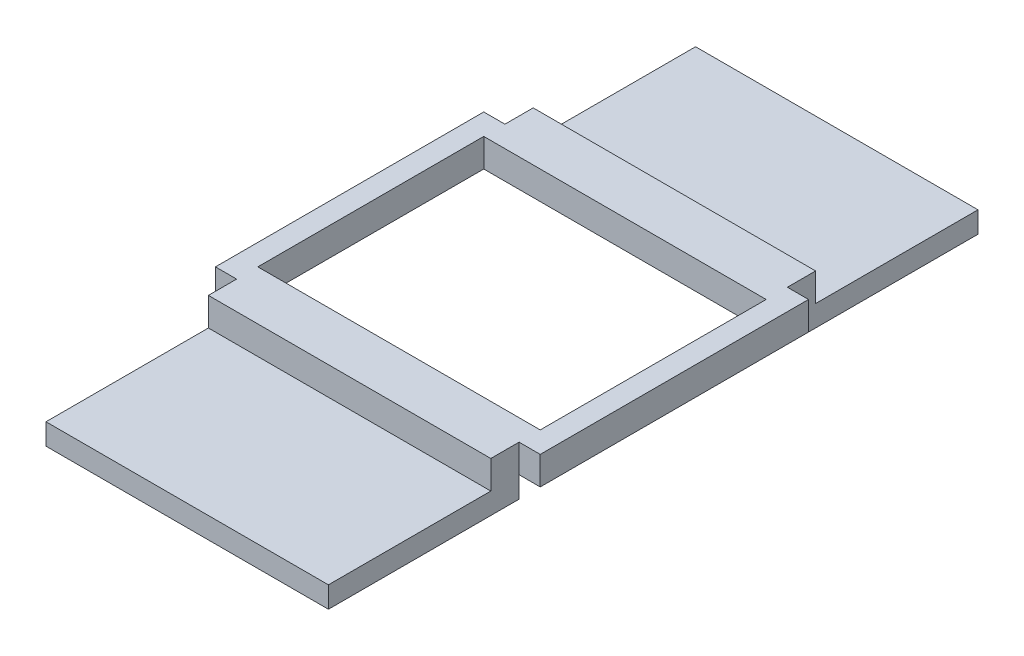
ISO-10303-21;
HEADER;
FILE_DESCRIPTION(('STEP AP214'),'2;1');
FILE_NAME('part.step','',(''),(''),'','','');
FILE_SCHEMA(('AUTOMOTIVE_DESIGN { 1 0 10303 214 1 1 1 1 }'));
ENDSEC;
DATA;
#1=APPLICATION_CONTEXT('core data for automotive mechanical design processes');
#2=APPLICATION_PROTOCOL_DEFINITION('international standard','automotive_design',2000,#1);
#3=PRODUCT_CONTEXT('',#1,'mechanical');
#4=PRODUCT('Part','Part','',(#3));
#5=PRODUCT_RELATED_PRODUCT_CATEGORY('part','',(#4));
#6=PRODUCT_DEFINITION_FORMATION('','',#4);
#7=PRODUCT_DEFINITION_CONTEXT('part definition',#1,'design');
#8=PRODUCT_DEFINITION('design','',#6,#7);
#9=PRODUCT_DEFINITION_SHAPE('','',#8);
#10=(LENGTH_UNIT() NAMED_UNIT(*) SI_UNIT(.MILLI.,.METRE.));
#11=(NAMED_UNIT(*) PLANE_ANGLE_UNIT() SI_UNIT($,.RADIAN.));
#12=(NAMED_UNIT(*) SI_UNIT($,.STERADIAN.) SOLID_ANGLE_UNIT());
#13=UNCERTAINTY_MEASURE_WITH_UNIT(LENGTH_MEASURE(1.E-05),#10,'distance_accuracy_value','');
#14=(GEOMETRIC_REPRESENTATION_CONTEXT(3) GLOBAL_UNCERTAINTY_ASSIGNED_CONTEXT((#13)) GLOBAL_UNIT_ASSIGNED_CONTEXT((#10,
#11,#12)) REPRESENTATION_CONTEXT('',''));
#15=CARTESIAN_POINT('',(0.,0.,0.));
#16=DIRECTION('',(0.,0.,1.));
#17=DIRECTION('',(1.,0.,0.));
#18=AXIS2_PLACEMENT_3D('',#15,#16,#17);
#19=CARTESIAN_POINT('',(-11.5,2.,9.5));
#20=DIRECTION('',(0.,0.,-1.));
#21=DIRECTION('',(-1.,0.,0.));
#22=AXIS2_PLACEMENT_3D('',#19,#20,#21);
#23=PLANE('',#22);
#24=DIRECTION('',(0.,-1.,0.));
#25=VECTOR('',#24,1.);
#26=CARTESIAN_POINT('',(-10.,2.,9.5));
#27=LINE('',#26,#25);
#28=CARTESIAN_POINT('',(-10.,2.,9.5));
#29=VERTEX_POINT('',#28);
#30=CARTESIAN_POINT('',(-10.,0.,9.5));
#31=VERTEX_POINT('',#30);
#32=EDGE_CURVE('E257',#29,#31,#27,.T.);
#33=ORIENTED_EDGE('',*,*,#32,.F.);
#34=DIRECTION('',(1.,0.,0.));
#35=VECTOR('',#34,1.);
#36=CARTESIAN_POINT('',(-11.5,2.,9.5));
#37=LINE('',#36,#35);
#38=CARTESIAN_POINT('',(-11.5,2.,9.5));
#39=VERTEX_POINT('',#38);
#40=EDGE_CURVE('E403',#39,#29,#37,.T.);
#41=ORIENTED_EDGE('',*,*,#40,.F.);
#42=DIRECTION('',(0.,-1.,0.));
#43=VECTOR('',#42,1.);
#44=CARTESIAN_POINT('',(-11.5,2.,9.5));
#45=LINE('',#44,#43);
#46=CARTESIAN_POINT('',(-11.5,0.,9.5));
#47=VERTEX_POINT('',#46);
#48=EDGE_CURVE('E426',#39,#47,#45,.T.);
#49=ORIENTED_EDGE('',*,*,#48,.T.);
#50=DIRECTION('',(1.,0.,0.));
#51=VECTOR('',#50,1.);
#52=CARTESIAN_POINT('',(-11.5,0.,9.5));
#53=LINE('',#52,#51);
#54=EDGE_CURVE('E394',#47,#31,#53,.T.);
#55=ORIENTED_EDGE('',*,*,#54,.T.);
#56=EDGE_LOOP('',(#33,#41,#49,#55));
#57=FACE_BOUND('',#56,.T.);
#58=ADVANCED_FACE('F45',(#57),#23,.F.);
#59=CARTESIAN_POINT('',(-11.5,2.,-9.5));
#60=DIRECTION('',(0.,0.,1.));
#61=DIRECTION('',(1.,0.,0.));
#62=AXIS2_PLACEMENT_3D('',#59,#60,#61);
#63=PLANE('',#62);
#64=DIRECTION('',(0.,-1.,0.));
#65=VECTOR('',#64,1.);
#66=CARTESIAN_POINT('',(10.,2.,-9.5));
#67=LINE('',#66,#65);
#68=CARTESIAN_POINT('',(10.,2.,-9.5));
#69=VERTEX_POINT('',#68);
#70=CARTESIAN_POINT('',(10.,0.,-9.5));
#71=VERTEX_POINT('',#70);
#72=EDGE_CURVE('E328',#69,#71,#67,.T.);
#73=ORIENTED_EDGE('',*,*,#72,.F.);
#74=DIRECTION('',(-1.,0.,0.));
#75=VECTOR('',#74,1.);
#76=CARTESIAN_POINT('',(-11.5,2.,-9.5));
#77=LINE('',#76,#75);
#78=CARTESIAN_POINT('',(11.5,2.,-9.5));
#79=VERTEX_POINT('',#78);
#80=EDGE_CURVE('E395',#79,#69,#77,.T.);
#81=ORIENTED_EDGE('',*,*,#80,.F.);
#82=DIRECTION('',(0.,-1.,0.));
#83=VECTOR('',#82,1.);
#84=CARTESIAN_POINT('',(11.5,2.,-9.5));
#85=LINE('',#84,#83);
#86=CARTESIAN_POINT('',(11.5,0.,-9.5));
#87=VERTEX_POINT('',#86);
#88=EDGE_CURVE('E11',#79,#87,#85,.T.);
#89=ORIENTED_EDGE('',*,*,#88,.T.);
#90=DIRECTION('',(-1.,0.,0.));
#91=VECTOR('',#90,1.);
#92=CARTESIAN_POINT('',(-11.5,0.,-9.5));
#93=LINE('',#92,#91);
#94=EDGE_CURVE('E412',#87,#71,#93,.T.);
#95=ORIENTED_EDGE('',*,*,#94,.T.);
#96=EDGE_LOOP('',(#73,#81,#89,#95));
#97=FACE_BOUND('',#96,.T.);
#98=ADVANCED_FACE('F472',(#97),#63,.F.);
#99=CARTESIAN_POINT('',(0.,2.,0.));
#100=DIRECTION('',(0.,1.,0.));
#101=DIRECTION('',(0.,0.,1.));
#102=AXIS2_PLACEMENT_3D('',#99,#100,#101);
#103=PLANE('',#102);
#104=DIRECTION('',(0.,0.,-1.));
#105=VECTOR('',#104,1.);
#106=CARTESIAN_POINT('',(11.5,2.,-9.5));
#107=LINE('',#106,#105);
#108=CARTESIAN_POINT('',(11.5,2.,9.5));
#109=VERTEX_POINT('',#108);
#110=EDGE_CURVE('E389',#109,#79,#107,.T.);
#111=ORIENTED_EDGE('',*,*,#110,.T.);
#112=ORIENTED_EDGE('',*,*,#80,.T.);
#113=DIRECTION('',(0.,0.,-1.));
#114=VECTOR('',#113,1.);
#115=CARTESIAN_POINT('',(10.,2.,-9.5));
#116=LINE('',#115,#114);
#117=CARTESIAN_POINT('',(10.,2.,-11.5));
#118=VERTEX_POINT('',#117);
#119=EDGE_CURVE('E318',#69,#118,#116,.T.);
#120=ORIENTED_EDGE('',*,*,#119,.T.);
#121=DIRECTION('',(-1.,0.,0.));
#122=VECTOR('',#121,1.);
#123=CARTESIAN_POINT('',(10.,2.,-11.5));
#124=LINE('',#123,#122);
#125=CARTESIAN_POINT('',(-10.,2.,-11.5));
#126=VERTEX_POINT('',#125);
#127=EDGE_CURVE('E322',#118,#126,#124,.T.);
#128=ORIENTED_EDGE('',*,*,#127,.T.);
#129=DIRECTION('',(0.,0.,1.));
#130=VECTOR('',#129,1.);
#131=CARTESIAN_POINT('',(-10.,2.,-9.5));
#132=LINE('',#131,#130);
#133=CARTESIAN_POINT('',(-10.,2.,-9.5));
#134=VERTEX_POINT('',#133);
#135=EDGE_CURVE('E325',#126,#134,#132,.T.);
#136=ORIENTED_EDGE('',*,*,#135,.T.);
#137=CARTESIAN_POINT('',(-11.5,2.,-9.5));
#138=VERTEX_POINT('',#137);
#139=EDGE_CURVE('E393',#134,#138,#77,.T.);
#140=ORIENTED_EDGE('',*,*,#139,.T.);
#141=DIRECTION('',(0.,0.,1.));
#142=VECTOR('',#141,1.);
#143=CARTESIAN_POINT('',(-11.5,2.,-9.5));
#144=LINE('',#143,#142);
#145=EDGE_CURVE('E399',#138,#39,#144,.T.);
#146=ORIENTED_EDGE('',*,*,#145,.T.);
#147=ORIENTED_EDGE('',*,*,#40,.T.);
#148=DIRECTION('',(0.,0.,1.));
#149=VECTOR('',#148,1.);
#150=CARTESIAN_POINT('',(-10.,2.,9.5));
#151=LINE('',#150,#149);
#152=CARTESIAN_POINT('',(-10.,2.,11.5));
#153=VERTEX_POINT('',#152);
#154=EDGE_CURVE('E267',#29,#153,#151,.T.);
#155=ORIENTED_EDGE('',*,*,#154,.T.);
#156=DIRECTION('',(1.,0.,0.));
#157=VECTOR('',#156,1.);
#158=CARTESIAN_POINT('',(-10.,2.,11.5));
#159=LINE('',#158,#157);
#160=CARTESIAN_POINT('',(10.,2.,11.5));
#161=VERTEX_POINT('',#160);
#162=EDGE_CURVE('E270',#153,#161,#159,.T.);
#163=ORIENTED_EDGE('',*,*,#162,.T.);
#164=DIRECTION('',(0.,0.,-1.));
#165=VECTOR('',#164,1.);
#166=CARTESIAN_POINT('',(10.,2.,9.5));
#167=LINE('',#166,#165);
#168=CARTESIAN_POINT('',(10.,2.,9.5));
#169=VERTEX_POINT('',#168);
#170=EDGE_CURVE('E261',#161,#169,#167,.T.);
#171=ORIENTED_EDGE('',*,*,#170,.T.);
#172=EDGE_CURVE('E402',#169,#109,#37,.T.);
#173=ORIENTED_EDGE('',*,*,#172,.T.);
#174=EDGE_LOOP('',(#111,#112,#120,#128,#136,#140,#146,#147,#155,#163,#171,#173));
#175=FACE_BOUND('',#174,.T.);
#176=DIRECTION('',(-1.,0.,0.));
#177=VECTOR('',#176,1.);
#178=CARTESIAN_POINT('',(-10.,2.,-8.));
#179=LINE('',#178,#177);
#180=CARTESIAN_POINT('',(10.,2.,-8.));
#181=VERTEX_POINT('',#180);
#182=CARTESIAN_POINT('',(-10.,2.,-8.));
#183=VERTEX_POINT('',#182);
#184=EDGE_CURVE('E351',#181,#183,#179,.T.);
#185=ORIENTED_EDGE('',*,*,#184,.F.);
#186=DIRECTION('',(0.,0.,-1.));
#187=VECTOR('',#186,1.);
#188=CARTESIAN_POINT('',(10.,2.,-8.));
#189=LINE('',#188,#187);
#190=CARTESIAN_POINT('',(10.,2.,8.));
#191=VERTEX_POINT('',#190);
#192=EDGE_CURVE('E348',#191,#181,#189,.T.);
#193=ORIENTED_EDGE('',*,*,#192,.F.);
#194=DIRECTION('',(1.,0.,0.));
#195=VECTOR('',#194,1.);
#196=CARTESIAN_POINT('',(-10.,2.,8.));
#197=LINE('',#196,#195);
#198=CARTESIAN_POINT('',(-10.,2.,8.));
#199=VERTEX_POINT('',#198);
#200=EDGE_CURVE('E358',#199,#191,#197,.T.);
#201=ORIENTED_EDGE('',*,*,#200,.F.);
#202=DIRECTION('',(0.,0.,1.));
#203=VECTOR('',#202,1.);
#204=CARTESIAN_POINT('',(-10.,2.,-8.));
#205=LINE('',#204,#203);
#206=EDGE_CURVE('E355',#183,#199,#205,.T.);
#207=ORIENTED_EDGE('',*,*,#206,.F.);
#208=EDGE_LOOP('',(#185,#193,#201,#207));
#209=FACE_BOUND('',#208,.T.);
#210=ADVANCED_FACE('F449',(#175,#209),#103,.T.);
#211=CARTESIAN_POINT('',(0.,0.,0.));
#212=DIRECTION('',(0.,1.,0.));
#213=DIRECTION('',(0.,0.,1.));
#214=AXIS2_PLACEMENT_3D('',#211,#212,#213);
#215=PLANE('',#214);
#216=CARTESIAN_POINT('',(10.,0.,9.5));
#217=VERTEX_POINT('',#216);
#218=CARTESIAN_POINT('',(11.5,0.,9.5));
#219=VERTEX_POINT('',#218);
#220=EDGE_CURVE('E419',#217,#219,#53,.T.);
#221=ORIENTED_EDGE('',*,*,#220,.F.);
#222=DIRECTION('',(-1.,0.,0.));
#223=VECTOR('',#222,1.);
#224=CARTESIAN_POINT('',(0.,0.,9.5));
#225=LINE('',#224,#223);
#226=EDGE_CURVE('E61',#217,#31,#225,.T.);
#227=ORIENTED_EDGE('',*,*,#226,.T.);
#228=ORIENTED_EDGE('',*,*,#54,.F.);
#229=DIRECTION('',(0.,0.,1.));
#230=VECTOR('',#229,1.);
#231=CARTESIAN_POINT('',(-11.5,0.,-9.5));
#232=LINE('',#231,#230);
#233=CARTESIAN_POINT('',(-11.5,0.,-9.5));
#234=VERTEX_POINT('',#233);
#235=EDGE_CURVE('E416',#234,#47,#232,.T.);
#236=ORIENTED_EDGE('',*,*,#235,.F.);
#237=CARTESIAN_POINT('',(-10.,0.,-9.5));
#238=VERTEX_POINT('',#237);
#239=EDGE_CURVE('E411',#238,#234,#93,.T.);
#240=ORIENTED_EDGE('',*,*,#239,.F.);
#241=DIRECTION('',(1.,0.,0.));
#242=VECTOR('',#241,1.);
#243=CARTESIAN_POINT('',(0.,0.,-9.5));
#244=LINE('',#243,#242);
#245=EDGE_CURVE('E266',#238,#71,#244,.T.);
#246=ORIENTED_EDGE('',*,*,#245,.T.);
#247=ORIENTED_EDGE('',*,*,#94,.F.);
#248=DIRECTION('',(0.,0.,-1.));
#249=VECTOR('',#248,1.);
#250=CARTESIAN_POINT('',(11.5,0.,-9.5));
#251=LINE('',#250,#249);
#252=EDGE_CURVE('E388',#219,#87,#251,.T.);
#253=ORIENTED_EDGE('',*,*,#252,.F.);
#254=EDGE_LOOP('',(#221,#227,#228,#236,#240,#246,#247,#253));
#255=FACE_BOUND('',#254,.T.);
#256=DIRECTION('',(0.,0.,-1.));
#257=VECTOR('',#256,1.);
#258=CARTESIAN_POINT('',(10.,0.,-8.));
#259=LINE('',#258,#257);
#260=CARTESIAN_POINT('',(10.,0.,8.));
#261=VERTEX_POINT('',#260);
#262=CARTESIAN_POINT('',(10.,0.,-8.));
#263=VERTEX_POINT('',#262);
#264=EDGE_CURVE('E347',#261,#263,#259,.T.);
#265=ORIENTED_EDGE('',*,*,#264,.T.);
#266=DIRECTION('',(-1.,0.,0.));
#267=VECTOR('',#266,1.);
#268=CARTESIAN_POINT('',(-10.,0.,-8.));
#269=LINE('',#268,#267);
#270=CARTESIAN_POINT('',(-10.,0.,-8.));
#271=VERTEX_POINT('',#270);
#272=EDGE_CURVE('E365',#263,#271,#269,.T.);
#273=ORIENTED_EDGE('',*,*,#272,.T.);
#274=DIRECTION('',(0.,0.,1.));
#275=VECTOR('',#274,1.);
#276=CARTESIAN_POINT('',(-10.,0.,-8.));
#277=LINE('',#276,#275);
#278=CARTESIAN_POINT('',(-10.,0.,8.));
#279=VERTEX_POINT('',#278);
#280=EDGE_CURVE('E369',#271,#279,#277,.T.);
#281=ORIENTED_EDGE('',*,*,#280,.T.);
#282=DIRECTION('',(1.,0.,0.));
#283=VECTOR('',#282,1.);
#284=CARTESIAN_POINT('',(-10.,0.,8.));
#285=LINE('',#284,#283);
#286=EDGE_CURVE('E352',#279,#261,#285,.T.);
#287=ORIENTED_EDGE('',*,*,#286,.T.);
#288=EDGE_LOOP('',(#265,#273,#281,#287));
#289=FACE_BOUND('',#288,.T.);
#290=ADVANCED_FACE('F443',(#255,#289),#215,.F.);
#291=CARTESIAN_POINT('',(11.5,2.,-9.5));
#292=DIRECTION('',(-1.,0.,0.));
#293=DIRECTION('',(0.,0.,1.));
#294=AXIS2_PLACEMENT_3D('',#291,#292,#293);
#295=PLANE('',#294);
#296=ORIENTED_EDGE('',*,*,#252,.T.);
#297=ORIENTED_EDGE('',*,*,#88,.F.);
#298=ORIENTED_EDGE('',*,*,#110,.F.);
#299=DIRECTION('',(0.,-1.,0.));
#300=VECTOR('',#299,1.);
#301=CARTESIAN_POINT('',(11.5,2.,9.5));
#302=LINE('',#301,#300);
#303=EDGE_CURVE('E407',#109,#219,#302,.T.);
#304=ORIENTED_EDGE('',*,*,#303,.T.);
#305=EDGE_LOOP('',(#296,#297,#298,#304));
#306=FACE_BOUND('',#305,.T.);
#307=ADVANCED_FACE('F47',(#306),#295,.F.);
#308=ORIENTED_EDGE('',*,*,#139,.F.);
#309=DIRECTION('',(0.,-1.,0.));
#310=VECTOR('',#309,1.);
#311=CARTESIAN_POINT('',(-10.,2.,-9.5));
#312=LINE('',#311,#310);
#313=EDGE_CURVE('E335',#134,#238,#312,.T.);
#314=ORIENTED_EDGE('',*,*,#313,.T.);
#315=ORIENTED_EDGE('',*,*,#239,.T.);
#316=DIRECTION('',(0.,-1.,0.));
#317=VECTOR('',#316,1.);
#318=CARTESIAN_POINT('',(-11.5,2.,-9.5));
#319=LINE('',#318,#317);
#320=EDGE_CURVE('E54',#138,#234,#319,.T.);
#321=ORIENTED_EDGE('',*,*,#320,.F.);
#322=EDGE_LOOP('',(#308,#314,#315,#321));
#323=FACE_BOUND('',#322,.T.);
#324=ADVANCED_FACE('F457',(#323),#63,.F.);
#325=CARTESIAN_POINT('',(-11.5,2.,-9.5));
#326=DIRECTION('',(1.,0.,0.));
#327=DIRECTION('',(0.,0.,-1.));
#328=AXIS2_PLACEMENT_3D('',#325,#326,#327);
#329=PLANE('',#328);
#330=ORIENTED_EDGE('',*,*,#235,.T.);
#331=ORIENTED_EDGE('',*,*,#48,.F.);
#332=ORIENTED_EDGE('',*,*,#145,.F.);
#333=ORIENTED_EDGE('',*,*,#320,.T.);
#334=EDGE_LOOP('',(#330,#331,#332,#333));
#335=FACE_BOUND('',#334,.T.);
#336=ADVANCED_FACE('F435',(#335),#329,.F.);
#337=ORIENTED_EDGE('',*,*,#172,.F.);
#338=DIRECTION('',(0.,-1.,0.));
#339=VECTOR('',#338,1.);
#340=CARTESIAN_POINT('',(10.,2.,9.5));
#341=LINE('',#340,#339);
#342=EDGE_CURVE('E254',#169,#217,#341,.T.);
#343=ORIENTED_EDGE('',*,*,#342,.T.);
#344=ORIENTED_EDGE('',*,*,#220,.T.);
#345=ORIENTED_EDGE('',*,*,#303,.F.);
#346=EDGE_LOOP('',(#337,#343,#344,#345));
#347=FACE_BOUND('',#346,.T.);
#348=ADVANCED_FACE('F479',(#347),#23,.F.);
#349=CARTESIAN_POINT('',(10.,2.,-8.));
#350=DIRECTION('',(-1.,0.,0.));
#351=DIRECTION('',(0.,0.,1.));
#352=AXIS2_PLACEMENT_3D('',#349,#350,#351);
#353=PLANE('',#352);
#354=ORIENTED_EDGE('',*,*,#264,.F.);
#355=DIRECTION('',(0.,-1.,0.));
#356=VECTOR('',#355,1.);
#357=CARTESIAN_POINT('',(10.,2.,8.));
#358=LINE('',#357,#356);
#359=EDGE_CURVE('E361',#191,#261,#358,.T.);
#360=ORIENTED_EDGE('',*,*,#359,.F.);
#361=ORIENTED_EDGE('',*,*,#192,.T.);
#362=DIRECTION('',(0.,-1.,0.));
#363=VECTOR('',#362,1.);
#364=CARTESIAN_POINT('',(10.,2.,-8.));
#365=LINE('',#364,#363);
#366=EDGE_CURVE('E384',#181,#263,#365,.T.);
#367=ORIENTED_EDGE('',*,*,#366,.T.);
#368=EDGE_LOOP('',(#354,#360,#361,#367));
#369=FACE_BOUND('',#368,.T.);
#370=ADVANCED_FACE('F510',(#369),#353,.T.);
#371=CARTESIAN_POINT('',(-10.,2.,-8.));
#372=DIRECTION('',(0.,0.,1.));
#373=DIRECTION('',(1.,0.,0.));
#374=AXIS2_PLACEMENT_3D('',#371,#372,#373);
#375=PLANE('',#374);
#376=ORIENTED_EDGE('',*,*,#272,.F.);
#377=ORIENTED_EDGE('',*,*,#366,.F.);
#378=ORIENTED_EDGE('',*,*,#184,.T.);
#379=DIRECTION('',(0.,-1.,0.));
#380=VECTOR('',#379,1.);
#381=CARTESIAN_POINT('',(-10.,2.,-8.));
#382=LINE('',#381,#380);
#383=EDGE_CURVE('E381',#183,#271,#382,.T.);
#384=ORIENTED_EDGE('',*,*,#383,.T.);
#385=EDGE_LOOP('',(#376,#377,#378,#384));
#386=FACE_BOUND('',#385,.T.);
#387=ADVANCED_FACE('F516',(#386),#375,.T.);
#388=CARTESIAN_POINT('',(-10.,2.,-8.));
#389=DIRECTION('',(1.,0.,0.));
#390=DIRECTION('',(0.,0.,-1.));
#391=AXIS2_PLACEMENT_3D('',#388,#389,#390);
#392=PLANE('',#391);
#393=ORIENTED_EDGE('',*,*,#280,.F.);
#394=ORIENTED_EDGE('',*,*,#383,.F.);
#395=ORIENTED_EDGE('',*,*,#206,.T.);
#396=DIRECTION('',(0.,-1.,0.));
#397=VECTOR('',#396,1.);
#398=CARTESIAN_POINT('',(-10.,2.,8.));
#399=LINE('',#398,#397);
#400=EDGE_CURVE('E69',#199,#279,#399,.T.);
#401=ORIENTED_EDGE('',*,*,#400,.T.);
#402=EDGE_LOOP('',(#393,#394,#395,#401));
#403=FACE_BOUND('',#402,.T.);
#404=ADVANCED_FACE('F535',(#403),#392,.T.);
#405=CARTESIAN_POINT('',(-10.,2.,8.));
#406=DIRECTION('',(0.,0.,-1.));
#407=DIRECTION('',(-1.,0.,0.));
#408=AXIS2_PLACEMENT_3D('',#405,#406,#407);
#409=PLANE('',#408);
#410=ORIENTED_EDGE('',*,*,#286,.F.);
#411=ORIENTED_EDGE('',*,*,#400,.F.);
#412=ORIENTED_EDGE('',*,*,#200,.T.);
#413=ORIENTED_EDGE('',*,*,#359,.T.);
#414=EDGE_LOOP('',(#410,#411,#412,#413));
#415=FACE_BOUND('',#414,.T.);
#416=ADVANCED_FACE('F539',(#415),#409,.T.);
#417=CARTESIAN_POINT('',(10.,2.,-9.5));
#418=DIRECTION('',(-1.,0.,0.));
#419=DIRECTION('',(0.,0.,1.));
#420=AXIS2_PLACEMENT_3D('',#417,#418,#419);
#421=PLANE('',#420);
#422=ORIENTED_EDGE('',*,*,#72,.T.);
#423=DIRECTION('',(0.,1.,0.));
#424=VECTOR('',#423,1.);
#425=CARTESIAN_POINT('',(10.,-1.5,-9.5));
#426=LINE('',#425,#424);
#427=CARTESIAN_POINT('',(10.,-1.5,-9.5));
#428=VERTEX_POINT('',#427);
#429=EDGE_CURVE('E291',#428,#71,#426,.T.);
#430=ORIENTED_EDGE('',*,*,#429,.F.);
#431=DIRECTION('',(0.,0.,-1.));
#432=VECTOR('',#431,1.);
#433=CARTESIAN_POINT('',(10.,-1.5,0.));
#434=LINE('',#433,#432);
#435=CARTESIAN_POINT('',(10.,-1.5,-23.));
#436=VERTEX_POINT('',#435);
#437=EDGE_CURVE('E287',#428,#436,#434,.T.);
#438=ORIENTED_EDGE('',*,*,#437,.T.);
#439=DIRECTION('',(0.,1.,0.));
#440=VECTOR('',#439,1.);
#441=CARTESIAN_POINT('',(10.,-1.5,-23.));
#442=LINE('',#441,#440);
#443=CARTESIAN_POINT('',(10.,0.,-23.));
#444=VERTEX_POINT('',#443);
#445=EDGE_CURVE('E306',#436,#444,#442,.T.);
#446=ORIENTED_EDGE('',*,*,#445,.T.);
#447=DIRECTION('',(0.,0.,-1.));
#448=VECTOR('',#447,1.);
#449=CARTESIAN_POINT('',(10.,0.,0.));
#450=LINE('',#449,#448);
#451=CARTESIAN_POINT('',(10.,0.,-11.5));
#452=VERTEX_POINT('',#451);
#453=EDGE_CURVE('E281',#452,#444,#450,.T.);
#454=ORIENTED_EDGE('',*,*,#453,.F.);
#455=DIRECTION('',(0.,-1.,0.));
#456=VECTOR('',#455,1.);
#457=CARTESIAN_POINT('',(10.,2.,-11.5));
#458=LINE('',#457,#456);
#459=EDGE_CURVE('E343',#118,#452,#458,.T.);
#460=ORIENTED_EDGE('',*,*,#459,.F.);
#461=ORIENTED_EDGE('',*,*,#119,.F.);
#462=EDGE_LOOP('',(#422,#430,#438,#446,#454,#460,#461));
#463=FACE_BOUND('',#462,.T.);
#464=ADVANCED_FACE('F469',(#463),#421,.F.);
#465=CARTESIAN_POINT('',(10.,2.,-11.5));
#466=DIRECTION('',(0.,0.,1.));
#467=DIRECTION('',(1.,0.,0.));
#468=AXIS2_PLACEMENT_3D('',#465,#466,#467);
#469=PLANE('',#468);
#470=DIRECTION('',(-1.,0.,0.));
#471=VECTOR('',#470,1.);
#472=CARTESIAN_POINT('',(10.,0.,-11.5));
#473=LINE('',#472,#471);
#474=CARTESIAN_POINT('',(-10.,0.,-11.5));
#475=VERTEX_POINT('',#474);
#476=EDGE_CURVE('E317',#452,#475,#473,.T.);
#477=ORIENTED_EDGE('',*,*,#476,.T.);
#478=DIRECTION('',(0.,-1.,0.));
#479=VECTOR('',#478,1.);
#480=CARTESIAN_POINT('',(-10.,2.,-11.5));
#481=LINE('',#480,#479);
#482=EDGE_CURVE('E339',#126,#475,#481,.T.);
#483=ORIENTED_EDGE('',*,*,#482,.F.);
#484=ORIENTED_EDGE('',*,*,#127,.F.);
#485=ORIENTED_EDGE('',*,*,#459,.T.);
#486=EDGE_LOOP('',(#477,#483,#484,#485));
#487=FACE_BOUND('',#486,.T.);
#488=ADVANCED_FACE('F543',(#487),#469,.F.);
#489=CARTESIAN_POINT('',(-10.,2.,-9.5));
#490=DIRECTION('',(1.,0.,0.));
#491=DIRECTION('',(0.,0.,-1.));
#492=AXIS2_PLACEMENT_3D('',#489,#490,#491);
#493=PLANE('',#492);
#494=ORIENTED_EDGE('',*,*,#482,.T.);
#495=DIRECTION('',(0.,0.,-1.));
#496=VECTOR('',#495,1.);
#497=CARTESIAN_POINT('',(-10.,0.,0.));
#498=LINE('',#497,#496);
#499=CARTESIAN_POINT('',(-10.,0.,-23.));
#500=VERTEX_POINT('',#499);
#501=EDGE_CURVE('E295',#475,#500,#498,.T.);
#502=ORIENTED_EDGE('',*,*,#501,.T.);
#503=DIRECTION('',(0.,1.,0.));
#504=VECTOR('',#503,1.);
#505=CARTESIAN_POINT('',(-10.,-1.5,-23.));
#506=LINE('',#505,#504);
#507=CARTESIAN_POINT('',(-10.,-1.5,-23.));
#508=VERTEX_POINT('',#507);
#509=EDGE_CURVE('E310',#508,#500,#506,.T.);
#510=ORIENTED_EDGE('',*,*,#509,.F.);
#511=DIRECTION('',(0.,0.,-1.));
#512=VECTOR('',#511,1.);
#513=CARTESIAN_POINT('',(-10.,-1.5,0.));
#514=LINE('',#513,#512);
#515=CARTESIAN_POINT('',(-10.,-1.5,-9.5));
#516=VERTEX_POINT('',#515);
#517=EDGE_CURVE('E280',#516,#508,#514,.T.);
#518=ORIENTED_EDGE('',*,*,#517,.F.);
#519=DIRECTION('',(0.,1.,0.));
#520=VECTOR('',#519,1.);
#521=CARTESIAN_POINT('',(-10.,-1.5,-9.5));
#522=LINE('',#521,#520);
#523=EDGE_CURVE('E314',#516,#238,#522,.T.);
#524=ORIENTED_EDGE('',*,*,#523,.T.);
#525=ORIENTED_EDGE('',*,*,#313,.F.);
#526=ORIENTED_EDGE('',*,*,#135,.F.);
#527=EDGE_LOOP('',(#494,#502,#510,#518,#524,#525,#526));
#528=FACE_BOUND('',#527,.T.);
#529=ADVANCED_FACE('F459',(#528),#493,.F.);
#530=CARTESIAN_POINT('',(0.,-1.5,-9.5));
#531=DIRECTION('',(0.,0.,1.));
#532=DIRECTION('',(1.,0.,0.));
#533=AXIS2_PLACEMENT_3D('',#530,#531,#532);
#534=PLANE('',#533);
#535=ORIENTED_EDGE('',*,*,#245,.F.);
#536=ORIENTED_EDGE('',*,*,#523,.F.);
#537=DIRECTION('',(1.,0.,0.));
#538=VECTOR('',#537,1.);
#539=CARTESIAN_POINT('',(0.,-1.5,-9.5));
#540=LINE('',#539,#538);
#541=EDGE_CURVE('E276',#516,#428,#540,.T.);
#542=ORIENTED_EDGE('',*,*,#541,.T.);
#543=ORIENTED_EDGE('',*,*,#429,.T.);
#544=EDGE_LOOP('',(#535,#536,#542,#543));
#545=FACE_BOUND('',#544,.T.);
#546=ADVANCED_FACE('F465',(#545),#534,.T.);
#547=CARTESIAN_POINT('',(0.,-1.5,-23.));
#548=DIRECTION('',(0.,0.,1.));
#549=DIRECTION('',(1.,0.,0.));
#550=AXIS2_PLACEMENT_3D('',#547,#548,#549);
#551=PLANE('',#550);
#552=DIRECTION('',(1.,0.,0.));
#553=VECTOR('',#552,1.);
#554=CARTESIAN_POINT('',(0.,0.,-23.));
#555=LINE('',#554,#553);
#556=EDGE_CURVE('E298',#500,#444,#555,.T.);
#557=ORIENTED_EDGE('',*,*,#556,.T.);
#558=ORIENTED_EDGE('',*,*,#445,.F.);
#559=DIRECTION('',(1.,0.,0.));
#560=VECTOR('',#559,1.);
#561=CARTESIAN_POINT('',(0.,-1.5,-23.));
#562=LINE('',#561,#560);
#563=EDGE_CURVE('E284',#508,#436,#562,.T.);
#564=ORIENTED_EDGE('',*,*,#563,.F.);
#565=ORIENTED_EDGE('',*,*,#509,.T.);
#566=EDGE_LOOP('',(#557,#558,#564,#565));
#567=FACE_BOUND('',#566,.T.);
#568=ADVANCED_FACE('F551',(#567),#551,.F.);
#569=CARTESIAN_POINT('',(0.,-1.5,0.));
#570=DIRECTION('',(0.,-1.,0.));
#571=DIRECTION('',(0.,0.,-1.));
#572=AXIS2_PLACEMENT_3D('',#569,#570,#571);
#573=PLANE('',#572);
#574=ORIENTED_EDGE('',*,*,#541,.F.);
#575=ORIENTED_EDGE('',*,*,#517,.T.);
#576=ORIENTED_EDGE('',*,*,#563,.T.);
#577=ORIENTED_EDGE('',*,*,#437,.F.);
#578=EDGE_LOOP('',(#574,#575,#576,#577));
#579=FACE_BOUND('',#578,.T.);
#580=ADVANCED_FACE('F554',(#579),#573,.T.);
#581=CARTESIAN_POINT('',(0.,0.,0.));
#582=DIRECTION('',(0.,-1.,0.));
#583=DIRECTION('',(0.,0.,-1.));
#584=AXIS2_PLACEMENT_3D('',#581,#582,#583);
#585=PLANE('',#584);
#586=ORIENTED_EDGE('',*,*,#476,.F.);
#587=ORIENTED_EDGE('',*,*,#453,.T.);
#588=ORIENTED_EDGE('',*,*,#556,.F.);
#589=ORIENTED_EDGE('',*,*,#501,.F.);
#590=EDGE_LOOP('',(#586,#587,#588,#589));
#591=FACE_BOUND('',#590,.T.);
#592=ADVANCED_FACE('F556',(#591),#585,.F.);
#593=CARTESIAN_POINT('',(-10.,2.,9.5));
#594=DIRECTION('',(1.,0.,0.));
#595=DIRECTION('',(0.,0.,-1.));
#596=AXIS2_PLACEMENT_3D('',#593,#594,#595);
#597=PLANE('',#596);
#598=ORIENTED_EDGE('',*,*,#32,.T.);
#599=DIRECTION('',(0.,1.,0.));
#600=VECTOR('',#599,1.);
#601=CARTESIAN_POINT('',(-10.,-1.5,9.5));
#602=LINE('',#601,#600);
#603=CARTESIAN_POINT('',(-10.,-1.5,9.5));
#604=VERTEX_POINT('',#603);
#605=EDGE_CURVE('E231',#604,#31,#602,.T.);
#606=ORIENTED_EDGE('',*,*,#605,.F.);
#607=DIRECTION('',(0.,0.,1.));
#608=VECTOR('',#607,1.);
#609=CARTESIAN_POINT('',(-10.,-1.5,0.));
#610=LINE('',#609,#608);
#611=CARTESIAN_POINT('',(-10.,-1.5,23.));
#612=VERTEX_POINT('',#611);
#613=EDGE_CURVE('E219',#604,#612,#610,.T.);
#614=ORIENTED_EDGE('',*,*,#613,.T.);
#615=DIRECTION('',(0.,1.,0.));
#616=VECTOR('',#615,1.);
#617=CARTESIAN_POINT('',(-10.,-1.5,23.));
#618=LINE('',#617,#616);
#619=CARTESIAN_POINT('',(-10.,0.,23.));
#620=VERTEX_POINT('',#619);
#621=EDGE_CURVE('E242',#612,#620,#618,.T.);
#622=ORIENTED_EDGE('',*,*,#621,.T.);
#623=DIRECTION('',(0.,0.,1.));
#624=VECTOR('',#623,1.);
#625=CARTESIAN_POINT('',(-10.,0.,0.));
#626=LINE('',#625,#624);
#627=CARTESIAN_POINT('',(-10.,0.,11.5));
#628=VERTEX_POINT('',#627);
#629=EDGE_CURVE('E221',#628,#620,#626,.T.);
#630=ORIENTED_EDGE('',*,*,#629,.F.);
#631=DIRECTION('',(0.,-1.,0.));
#632=VECTOR('',#631,1.);
#633=CARTESIAN_POINT('',(-10.,2.,11.5));
#634=LINE('',#633,#632);
#635=EDGE_CURVE('E203',#153,#628,#634,.T.);
#636=ORIENTED_EDGE('',*,*,#635,.F.);
#637=ORIENTED_EDGE('',*,*,#154,.F.);
#638=EDGE_LOOP('',(#598,#606,#614,#622,#630,#636,#637));
#639=FACE_BOUND('',#638,.T.);
#640=ADVANCED_FACE('F488',(#639),#597,.F.);
#641=CARTESIAN_POINT('',(-10.,2.,11.5));
#642=DIRECTION('',(0.,0.,-1.));
#643=DIRECTION('',(-1.,0.,0.));
#644=AXIS2_PLACEMENT_3D('',#641,#642,#643);
#645=PLANE('',#644);
#646=DIRECTION('',(1.,0.,0.));
#647=VECTOR('',#646,1.);
#648=CARTESIAN_POINT('',(-10.,0.,11.5));
#649=LINE('',#648,#647);
#650=CARTESIAN_POINT('',(10.,0.,11.5));
#651=VERTEX_POINT('',#650);
#652=EDGE_CURVE('E262',#628,#651,#649,.T.);
#653=ORIENTED_EDGE('',*,*,#652,.T.);
#654=DIRECTION('',(0.,-1.,0.));
#655=VECTOR('',#654,1.);
#656=CARTESIAN_POINT('',(10.,2.,11.5));
#657=LINE('',#656,#655);
#658=EDGE_CURVE('E251',#161,#651,#657,.T.);
#659=ORIENTED_EDGE('',*,*,#658,.F.);
#660=ORIENTED_EDGE('',*,*,#162,.F.);
#661=ORIENTED_EDGE('',*,*,#635,.T.);
#662=EDGE_LOOP('',(#653,#659,#660,#661));
#663=FACE_BOUND('',#662,.T.);
#664=ADVANCED_FACE('F483',(#663),#645,.F.);
#665=CARTESIAN_POINT('',(10.,2.,9.5));
#666=DIRECTION('',(-1.,0.,0.));
#667=DIRECTION('',(0.,0.,1.));
#668=AXIS2_PLACEMENT_3D('',#665,#666,#667);
#669=PLANE('',#668);
#670=ORIENTED_EDGE('',*,*,#658,.T.);
#671=DIRECTION('',(0.,0.,1.));
#672=VECTOR('',#671,1.);
#673=CARTESIAN_POINT('',(10.,0.,0.));
#674=LINE('',#673,#672);
#675=CARTESIAN_POINT('',(10.,0.,23.));
#676=VERTEX_POINT('',#675);
#677=EDGE_CURVE('E234',#651,#676,#674,.T.);
#678=ORIENTED_EDGE('',*,*,#677,.T.);
#679=DIRECTION('',(0.,1.,0.));
#680=VECTOR('',#679,1.);
#681=CARTESIAN_POINT('',(10.,-1.5,23.));
#682=LINE('',#681,#680);
#683=CARTESIAN_POINT('',(10.,-1.5,23.));
#684=VERTEX_POINT('',#683);
#685=EDGE_CURVE('E204',#684,#676,#682,.T.);
#686=ORIENTED_EDGE('',*,*,#685,.F.);
#687=DIRECTION('',(0.,0.,1.));
#688=VECTOR('',#687,1.);
#689=CARTESIAN_POINT('',(10.,-1.5,0.));
#690=LINE('',#689,#688);
#691=CARTESIAN_POINT('',(10.,-1.5,9.5));
#692=VERTEX_POINT('',#691);
#693=EDGE_CURVE('E207',#692,#684,#690,.T.);
#694=ORIENTED_EDGE('',*,*,#693,.F.);
#695=DIRECTION('',(0.,1.,0.));
#696=VECTOR('',#695,1.);
#697=CARTESIAN_POINT('',(10.,-1.5,9.5));
#698=LINE('',#697,#696);
#699=EDGE_CURVE('E193',#692,#217,#698,.T.);
#700=ORIENTED_EDGE('',*,*,#699,.T.);
#701=ORIENTED_EDGE('',*,*,#342,.F.);
#702=ORIENTED_EDGE('',*,*,#170,.F.);
#703=EDGE_LOOP('',(#670,#678,#686,#694,#700,#701,#702));
#704=FACE_BOUND('',#703,.T.);
#705=ADVANCED_FACE('F209',(#704),#669,.F.);
#706=CARTESIAN_POINT('',(0.,0.,0.));
#707=DIRECTION('',(0.,-1.,0.));
#708=DIRECTION('',(0.,0.,-1.));
#709=AXIS2_PLACEMENT_3D('',#706,#707,#708);
#710=PLANE('',#709);
#711=ORIENTED_EDGE('',*,*,#677,.F.);
#712=ORIENTED_EDGE('',*,*,#652,.F.);
#713=ORIENTED_EDGE('',*,*,#629,.T.);
#714=DIRECTION('',(1.,0.,0.));
#715=VECTOR('',#714,1.);
#716=CARTESIAN_POINT('',(0.,0.,23.));
#717=LINE('',#716,#715);
#718=EDGE_CURVE('E224',#620,#676,#717,.T.);
#719=ORIENTED_EDGE('',*,*,#718,.T.);
#720=EDGE_LOOP('',(#711,#712,#713,#719));
#721=FACE_BOUND('',#720,.T.);
#722=ADVANCED_FACE('F486',(#721),#710,.F.);
#723=CARTESIAN_POINT('',(0.,-1.5,9.5));
#724=DIRECTION('',(0.,0.,-1.));
#725=DIRECTION('',(-1.,0.,0.));
#726=AXIS2_PLACEMENT_3D('',#723,#724,#725);
#727=PLANE('',#726);
#728=ORIENTED_EDGE('',*,*,#226,.F.);
#729=ORIENTED_EDGE('',*,*,#699,.F.);
#730=DIRECTION('',(-1.,0.,0.));
#731=VECTOR('',#730,1.);
#732=CARTESIAN_POINT('',(0.,-1.5,9.5));
#733=LINE('',#732,#731);
#734=EDGE_CURVE('E197',#692,#604,#733,.T.);
#735=ORIENTED_EDGE('',*,*,#734,.T.);
#736=ORIENTED_EDGE('',*,*,#605,.T.);
#737=EDGE_LOOP('',(#728,#729,#735,#736));
#738=FACE_BOUND('',#737,.T.);
#739=ADVANCED_FACE('F195',(#738),#727,.T.);
#740=CARTESIAN_POINT('',(0.,-1.5,23.));
#741=DIRECTION('',(0.,0.,1.));
#742=DIRECTION('',(1.,0.,0.));
#743=AXIS2_PLACEMENT_3D('',#740,#741,#742);
#744=PLANE('',#743);
#745=ORIENTED_EDGE('',*,*,#718,.F.);
#746=ORIENTED_EDGE('',*,*,#621,.F.);
#747=DIRECTION('',(1.,0.,0.));
#748=VECTOR('',#747,1.);
#749=CARTESIAN_POINT('',(0.,-1.5,23.));
#750=LINE('',#749,#748);
#751=EDGE_CURVE('E215',#612,#684,#750,.T.);
#752=ORIENTED_EDGE('',*,*,#751,.T.);
#753=ORIENTED_EDGE('',*,*,#685,.T.);
#754=EDGE_LOOP('',(#745,#746,#752,#753));
#755=FACE_BOUND('',#754,.T.);
#756=ADVANCED_FACE('F491',(#755),#744,.T.);
#757=CARTESIAN_POINT('',(0.,-1.5,0.));
#758=DIRECTION('',(0.,-1.,0.));
#759=DIRECTION('',(0.,0.,-1.));
#760=AXIS2_PLACEMENT_3D('',#757,#758,#759);
#761=PLANE('',#760);
#762=ORIENTED_EDGE('',*,*,#734,.F.);
#763=ORIENTED_EDGE('',*,*,#693,.T.);
#764=ORIENTED_EDGE('',*,*,#751,.F.);
#765=ORIENTED_EDGE('',*,*,#613,.F.);
#766=EDGE_LOOP('',(#762,#763,#764,#765));
#767=FACE_BOUND('',#766,.T.);
#768=ADVANCED_FACE('F217',(#767),#761,.T.);
#769=CLOSED_SHELL('',(#58,#98,#210,#290,#307,#324,#336,#348,#370,#387,#404,#416,#464,#488,#529,
#546,#568,#580,#592,#640,#664,#705,#722,#739,#756,#768));
#770=MANIFOLD_SOLID_BREP('B2',#769);
#771=ADVANCED_BREP_SHAPE_REPRESENTATION('',(#18,#770),#14);
#772=SHAPE_DEFINITION_REPRESENTATION(#9,#771);
ENDSEC;
END-ISO-10303-21;
